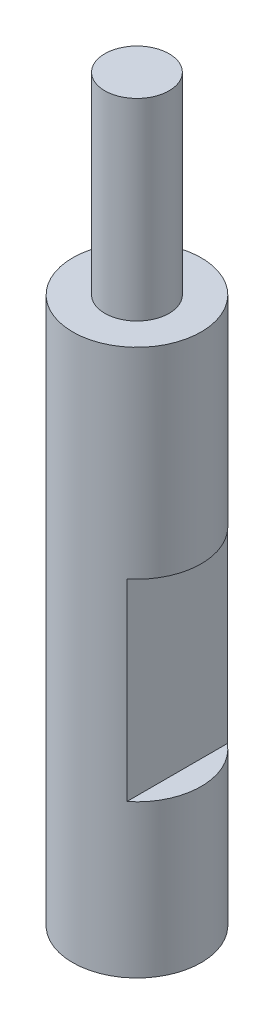
ISO-10303-21;
HEADER;
FILE_DESCRIPTION(('STEP AP214'),'2;1');
FILE_NAME('part.step','',(''),(''),'','','');
FILE_SCHEMA(('AUTOMOTIVE_DESIGN { 1 0 10303 214 1 1 1 1 }'));
ENDSEC;
DATA;
#1=APPLICATION_CONTEXT('core data for automotive mechanical design processes');
#2=APPLICATION_PROTOCOL_DEFINITION('international standard','automotive_design',2000,#1);
#3=PRODUCT_CONTEXT('',#1,'mechanical');
#4=PRODUCT('Part','Part','',(#3));
#5=PRODUCT_RELATED_PRODUCT_CATEGORY('part','',(#4));
#6=PRODUCT_DEFINITION_FORMATION('','',#4);
#7=PRODUCT_DEFINITION_CONTEXT('part definition',#1,'design');
#8=PRODUCT_DEFINITION('design','',#6,#7);
#9=PRODUCT_DEFINITION_SHAPE('','',#8);
#10=(LENGTH_UNIT() NAMED_UNIT(*) SI_UNIT(.MILLI.,.METRE.));
#11=(NAMED_UNIT(*) PLANE_ANGLE_UNIT() SI_UNIT($,.RADIAN.));
#12=(NAMED_UNIT(*) SI_UNIT($,.STERADIAN.) SOLID_ANGLE_UNIT());
#13=UNCERTAINTY_MEASURE_WITH_UNIT(LENGTH_MEASURE(1.E-05),#10,'distance_accuracy_value','');
#14=(GEOMETRIC_REPRESENTATION_CONTEXT(3) GLOBAL_UNCERTAINTY_ASSIGNED_CONTEXT((#13)) GLOBAL_UNIT_ASSIGNED_CONTEXT((#10,
#11,#12)) REPRESENTATION_CONTEXT('',''));
#15=CARTESIAN_POINT('',(0.,0.,0.));
#16=DIRECTION('',(0.,0.,1.));
#17=DIRECTION('',(1.,0.,0.));
#18=AXIS2_PLACEMENT_3D('',#15,#16,#17);
#19=CARTESIAN_POINT('',(0.,34.,0.));
#20=DIRECTION('',(0.,-1.,0.));
#21=DIRECTION('',(0.,0.,-1.));
#22=AXIS2_PLACEMENT_3D('',#19,#20,#21);
#23=CYLINDRICAL_SURFACE('',#22,4.);
#24=CARTESIAN_POINT('',(-3.46410161513775,11.5,-2.));
#25=CARTESIAN_POINT('',(-3.46411185715887,11.6042132054743,-1.99999158748781));
#26=CARTESIAN_POINT('',(-3.46887633544978,11.7085621765338,-1.99179963610437));
#27=CARTESIAN_POINT('',(-3.48724701669072,11.9140551772306,-1.95944672580053));
#28=CARTESIAN_POINT('',(-3.50087179788182,12.0151920032478,-1.93525221095662));
#29=CARTESIAN_POINT('',(-3.53498701490001,12.2109031564469,-1.8721998159803));
#30=CARTESIAN_POINT('',(-3.55544089069169,12.3055092588492,-1.83341988295964));
#31=CARTESIAN_POINT('',(-3.60085327291132,12.4868484504762,-1.74253507245138));
#32=CARTESIAN_POINT('',(-3.62581202301253,12.5735811134368,-1.69042947410139));
#33=CARTESIAN_POINT('',(-3.67993738819289,12.7446114431334,-1.569333074538));
#34=CARTESIAN_POINT('',(-3.70928127465103,12.8281182675918,-1.49930407053533));
#35=CARTESIAN_POINT('',(-3.76743965382121,12.9828167805706,-1.34650761698202));
#36=CARTESIAN_POINT('',(-3.79625387610258,13.054002326204,-1.26373385204841));
#37=CARTESIAN_POINT('',(-3.85242953961661,13.1867343011885,-1.08097912631265));
#38=CARTESIAN_POINT('',(-3.87956212851245,13.2473075354233,-0.980214377887153));
#39=CARTESIAN_POINT('',(-3.92701512184167,13.3502817067871,-0.768314053336918));
#40=CARTESIAN_POINT('',(-3.94733982363631,13.3926941123508,-0.657185076311987));
#41=CARTESIAN_POINT('',(-3.97760922492053,13.4550093225312,-0.436089887818819));
#42=CARTESIAN_POINT('',(-3.98818960442739,13.4762990526921,-0.326603580968787));
#43=CARTESIAN_POINT('',(-4.00015167691179,13.500332237369,-0.105141257404542));
#44=CARTESIAN_POINT('',(-4.00153893568934,13.5030869135963,0.00683321168520598));
#45=CARTESIAN_POINT('',(-3.99525963833124,13.4905066520549,0.219665048849571));
#46=CARTESIAN_POINT('',(-3.98836991784381,13.4767239689564,0.320642398354137));
#47=CARTESIAN_POINT('',(-3.96748490519435,13.4342383121919,0.518627543836087));
#48=CARTESIAN_POINT('',(-3.95348908132771,13.4055342220479,0.6156350421877));
#49=CARTESIAN_POINT('',(-3.91943166575325,13.33383486782,0.804618783139258));
#50=CARTESIAN_POINT('',(-3.89928883058403,13.2906473736558,0.896506847030397));
#51=CARTESIAN_POINT('',(-3.8547529197337,13.1914731675971,1.07195360302662));
#52=CARTESIAN_POINT('',(-3.83035832314967,13.1354818733953,1.15550929767728));
#53=CARTESIAN_POINT('',(-3.7768878879846,13.0062092969339,1.3203473217964));
#54=CARTESIAN_POINT('',(-3.7475875199635,12.931793943348,1.40066815005872));
#55=CARTESIAN_POINT('',(-3.68908681173623,12.7708205501397,1.54820874059556));
#56=CARTESIAN_POINT('',(-3.65988656531257,12.6842532554519,1.61541842314846));
#57=CARTESIAN_POINT('',(-3.60288312184969,12.4947036151518,1.73901066928442));
#58=CARTESIAN_POINT('',(-3.57528639981415,12.3910279538916,1.7944346299561));
#59=CARTESIAN_POINT('',(-3.52750900557152,12.174124657282,1.88663822600246));
#60=CARTESIAN_POINT('',(-3.50732060092135,12.0609071339649,1.92343731642178));
#61=CARTESIAN_POINT('',(-3.47889271634069,11.8375709774344,1.97436042205008));
#62=CARTESIAN_POINT('',(-3.46983311696993,11.7279177619129,1.99005024423995));
#63=CARTESIAN_POINT('',(-3.46235838723219,11.5071973169669,2.00303389322285));
#64=CARTESIAN_POINT('',(-3.46393573778623,11.3961311417604,2.00034071463005));
#65=CARTESIAN_POINT('',(-3.4766867308117,11.1886921628426,1.97807208668793));
#66=CARTESIAN_POINT('',(-3.48679175013308,11.0920410977842,1.96037563342492));
#67=CARTESIAN_POINT('',(-3.51388043102682,10.903264427458,1.91139256926489));
#68=CARTESIAN_POINT('',(-3.53086632010068,10.8111402985065,1.88010155724727));
#69=CARTESIAN_POINT('',(-3.57072444159313,10.6291773381949,1.80329517720973));
#70=CARTESIAN_POINT('',(-3.59383286486125,10.5396419662939,1.7571881273853));
#71=CARTESIAN_POINT('',(-3.643122389945,10.369061456921,1.65257412803176));
#72=CARTESIAN_POINT('',(-3.66930506710298,10.2880207129695,1.59406080866499));
#73=CARTESIAN_POINT('',(-3.72575996912669,10.1260424649573,1.45767433439709));
#74=CARTESIAN_POINT('',(-3.75613166308566,10.0464056985822,1.37829054462748));
#75=CARTESIAN_POINT('',(-3.81468469955797,9.90117552399527,1.20680899079904));
#76=CARTESIAN_POINT('',(-3.84286530015463,9.83558685947316,1.11470694931991));
#77=CARTESIAN_POINT('',(-3.89482723381867,9.71885254816729,0.91707072510806));
#78=CARTESIAN_POINT('',(-3.91847283343884,9.66813376383323,0.811246195112496));
#79=CARTESIAN_POINT('',(-3.95766709918776,9.58572419203039,0.591044729317866));
#80=CARTESIAN_POINT('',(-3.97322287353397,9.5540166963159,0.476675402917653));
#81=CARTESIAN_POINT('',(-3.99335016363174,9.51326287251486,0.253959364539765));
#82=CARTESIAN_POINT('',(-3.9987985581427,9.50240425133572,0.146022887268302));
#83=CARTESIAN_POINT('',(-4.00084260752374,9.49831346600432,-0.0702519714699439));
#84=CARTESIAN_POINT('',(-3.99744136141634,9.50507513147113,-0.178590198981613));
#85=CARTESIAN_POINT('',(-3.98267937668509,9.5348328243164,-0.385075986136858));
#86=CARTESIAN_POINT('',(-3.97185789309443,9.55672973730905,-0.483424641057418));
#87=CARTESIAN_POINT('',(-3.94384187353387,9.61465395980667,-0.674891898931564));
#88=CARTESIAN_POINT('',(-3.92664642364424,9.65068329570691,-0.768009749669771));
#89=CARTESIAN_POINT('',(-3.8865186139318,9.7374542549914,-0.95084683359674));
#90=CARTESIAN_POINT('',(-3.86337234005404,9.78875921975186,-1.0402503657229));
#91=CARTESIAN_POINT('',(-3.81376266676027,9.90391528811809,-1.20954920326828));
#92=CARTESIAN_POINT('',(-3.78729774583427,9.96777215410157,-1.28944011444319));
#93=CARTESIAN_POINT('',(-3.73057218840582,10.1135966355594,-1.44582833859495));
#94=CARTESIAN_POINT('',(-3.70019591726075,10.1967341808003,-1.52119665879199));
#95=CARTESIAN_POINT('',(-3.64126158628571,10.3748922283061,-1.65732528394006));
#96=CARTESIAN_POINT('',(-3.61270515130784,10.4699231313605,-1.71807266521244));
#97=CARTESIAN_POINT('',(-3.55999186256751,10.6733088941302,-1.82486714716811));
#98=CARTESIAN_POINT('',(-3.53600256268535,10.7819899107353,-1.87038902381914));
#99=CARTESIAN_POINT('',(-3.5069621813237,10.9505781196309,-1.92395929504801));
#100=CARTESIAN_POINT('',(-3.49844389329401,11.0076478205907,-1.93935666147967));
#101=CARTESIAN_POINT('',(-3.48406059323535,11.1232325575002,-1.96508069805043));
#102=CARTESIAN_POINT('',(-3.4781937263605,11.1817465527542,-1.97541091343282));
#103=CARTESIAN_POINT('',(-3.47059023668758,11.2836007892473,-1.9887293296122));
#104=CARTESIAN_POINT('',(-3.46816389731815,11.3267330572501,-1.99295091983786));
#105=CARTESIAN_POINT('',(-3.46491740045177,11.4132356930929,-1.99858810035606));
#106=CARTESIAN_POINT('',(-3.46409735040492,11.4566060766667,-2.00000350293331));
#107=CARTESIAN_POINT('',(-3.46410161513775,11.5,-2.));
#108=B_SPLINE_CURVE_WITH_KNOTS('',3,(#24,#25,#26,#27,#28,#29,#30,#31,#32,#33,#34,#35,#36,#37,
#38,#39,#40,#41,#42,#43,#44,#45,#46,#47,#48,#49,#50,#51,#52,#53,#54,#55,#56,#57,#58,#59,#60,#61,
#62,#63,#64,#65,#66,#67,#68,#69,#70,#71,#72,#73,#74,#75,#76,#77,#78,#79,#80,#81,#82,#83,#84,#85,
#86,#87,#88,#89,#90,#91,#92,#93,#94,#95,#96,#97,#98,#99,#100,#101,#102,#103,#104,#105,#106,
#107),.UNSPECIFIED.,.T.,.F.,(4,2,2,2,2,2,2,2,2,2,2,2,2,2,2,2,2,2,2,2,2,2,2,2,2,2,2,2,2,2,2,2,2,
2,2,2,2,2,2,2,2,4),(0.,0.312464245189432,0.62558578564961,0.937057191861534,1.24854545093096,
1.58572462503713,1.92307142172809,2.28315784481594,2.64301653931849,2.97726969939937,
3.31132047376147,3.61632194973143,3.92134625038977,4.2305906946636,4.5399459870461,
4.87854382917848,5.21740096495904,5.57777683462963,5.93777548427476,6.2692458171249,
6.60048186380813,6.89548366852118,7.19058104876193,7.49934592816242,7.80826972444161,
8.15613487165293,8.50411729960471,8.86128362829998,9.2181355962161,9.5422454078304,
9.8662417359201,10.1688884974705,10.4715786702809,10.7872150144301,11.102996602055,
11.450204837042,11.7977188569438,12.1562149808128,12.3351395323571,12.5139387197526,
12.6440387634036,12.7741475095882),.UNSPECIFIED.);
#109=CARTESIAN_POINT('',(-3.46410161513775,11.5,-2.));
#110=VERTEX_POINT('',#109);
#111=EDGE_CURVE('E120',#110,#110,#108,.T.);
#112=ORIENTED_EDGE('',*,*,#111,.T.);
#113=EDGE_LOOP('',(#112));
#114=FACE_BOUND('',#113,.T.);
#115=DIRECTION('',(0.,-1.,0.));
#116=VECTOR('',#115,1.);
#117=CARTESIAN_POINT('',(2.5,34.,3.1224989991992));
#118=LINE('',#117,#116);
#119=CARTESIAN_POINT('',(2.5,9.5,3.1224989991992));
#120=VERTEX_POINT('',#119);
#121=CARTESIAN_POINT('',(2.5,21.5,3.1224989991992));
#122=VERTEX_POINT('',#121);
#123=EDGE_CURVE('E154',#120,#122,#118,.F.);
#124=ORIENTED_EDGE('',*,*,#123,.T.);
#125=CARTESIAN_POINT('',(0.,21.5,0.));
#126=DIRECTION('',(0.,1.,0.));
#127=DIRECTION('',(-1.,0.,0.));
#128=AXIS2_PLACEMENT_3D('',#125,#126,#127);
#129=CIRCLE('',#128,4.);
#130=CARTESIAN_POINT('',(2.5,21.5,-3.1224989991992));
#131=VERTEX_POINT('',#130);
#132=EDGE_CURVE('E60',#122,#131,#129,.T.);
#133=ORIENTED_EDGE('',*,*,#132,.T.);
#134=DIRECTION('',(0.,-1.,0.));
#135=VECTOR('',#134,1.);
#136=CARTESIAN_POINT('',(2.5,34.,-3.1224989991992));
#137=LINE('',#136,#135);
#138=CARTESIAN_POINT('',(2.5,9.5,-3.1224989991992));
#139=VERTEX_POINT('',#138);
#140=EDGE_CURVE('E157',#131,#139,#137,.T.);
#141=ORIENTED_EDGE('',*,*,#140,.T.);
#142=CARTESIAN_POINT('',(0.,9.49999999999999,0.));
#143=DIRECTION('',(0.,-1.,0.));
#144=DIRECTION('',(1.,0.,0.));
#145=AXIS2_PLACEMENT_3D('',#142,#143,#144);
#146=CIRCLE('',#145,4.);
#147=EDGE_CURVE('E147',#139,#120,#146,.T.);
#148=ORIENTED_EDGE('',*,*,#147,.T.);
#149=EDGE_LOOP('',(#124,#133,#141,#148));
#150=FACE_BOUND('',#149,.T.);
#151=CARTESIAN_POINT('',(0.,34.,0.));
#152=DIRECTION('',(0.,1.,0.));
#153=DIRECTION('',(0.,0.,1.));
#154=AXIS2_PLACEMENT_3D('',#151,#152,#153);
#155=CIRCLE('',#154,4.);
#156=CARTESIAN_POINT('',(0.,34.,4.));
#157=VERTEX_POINT('',#156);
#158=EDGE_CURVE('E148',#157,#157,#155,.T.);
#159=ORIENTED_EDGE('',*,*,#158,.F.);
#160=EDGE_LOOP('',(#159));
#161=FACE_BOUND('',#160,.T.);
#162=CARTESIAN_POINT('',(0.,0.,0.));
#163=DIRECTION('',(0.,1.,0.));
#164=DIRECTION('',(0.,0.,1.));
#165=AXIS2_PLACEMENT_3D('',#162,#163,#164);
#166=CIRCLE('',#165,4.);
#167=CARTESIAN_POINT('',(0.,0.,4.));
#168=VERTEX_POINT('',#167);
#169=EDGE_CURVE('E143',#168,#168,#166,.T.);
#170=ORIENTED_EDGE('',*,*,#169,.T.);
#171=EDGE_LOOP('',(#170));
#172=FACE_BOUND('',#171,.T.);
#173=ADVANCED_FACE('F39',(#114,#150,#161,#172),#23,.T.);
#174=CARTESIAN_POINT('',(0.,34.,0.));
#175=DIRECTION('',(0.,1.,0.));
#176=DIRECTION('',(0.,0.,1.));
#177=AXIS2_PLACEMENT_3D('',#174,#175,#176);
#178=PLANE('',#177);
#179=CARTESIAN_POINT('',(0.,34.,0.));
#180=DIRECTION('',(0.,1.,0.));
#181=DIRECTION('',(0.,0.,1.));
#182=AXIS2_PLACEMENT_3D('',#179,#180,#181);
#183=CIRCLE('',#182,2.);
#184=CARTESIAN_POINT('',(0.,34.,2.));
#185=VERTEX_POINT('',#184);
#186=EDGE_CURVE('E144',#185,#185,#183,.T.);
#187=ORIENTED_EDGE('',*,*,#186,.F.);
#188=EDGE_LOOP('',(#187));
#189=FACE_BOUND('',#188,.T.);
#190=ORIENTED_EDGE('',*,*,#158,.T.);
#191=EDGE_LOOP('',(#190));
#192=FACE_BOUND('',#191,.T.);
#193=ADVANCED_FACE('F180',(#189,#192),#178,.T.);
#194=CARTESIAN_POINT('',(0.,0.,0.));
#195=DIRECTION('',(0.,1.,0.));
#196=DIRECTION('',(0.,0.,1.));
#197=AXIS2_PLACEMENT_3D('',#194,#195,#196);
#198=PLANE('',#197);
#199=CARTESIAN_POINT('',(0.,0.,0.));
#200=DIRECTION('',(0.,-1.,0.));
#201=DIRECTION('',(0.,0.,-1.));
#202=AXIS2_PLACEMENT_3D('',#199,#200,#201);
#203=CIRCLE('',#202,1.525);
#204=CARTESIAN_POINT('',(0.,0.,-1.525));
#205=VERTEX_POINT('',#204);
#206=EDGE_CURVE('E126',#205,#205,#203,.T.);
#207=ORIENTED_EDGE('',*,*,#206,.F.);
#208=EDGE_LOOP('',(#207));
#209=FACE_BOUND('',#208,.T.);
#210=ORIENTED_EDGE('',*,*,#169,.F.);
#211=EDGE_LOOP('',(#210));
#212=FACE_BOUND('',#211,.T.);
#213=ADVANCED_FACE('F185',(#209,#212),#198,.F.);
#214=CARTESIAN_POINT('',(0.,46.,0.));
#215=DIRECTION('',(0.,-1.,0.));
#216=DIRECTION('',(0.,0.,-1.));
#217=AXIS2_PLACEMENT_3D('',#214,#215,#216);
#218=CYLINDRICAL_SURFACE('',#217,2.);
#219=CARTESIAN_POINT('',(0.,46.,0.));
#220=DIRECTION('',(0.,1.,0.));
#221=DIRECTION('',(0.,0.,1.));
#222=AXIS2_PLACEMENT_3D('',#219,#220,#221);
#223=CIRCLE('',#222,2.);
#224=CARTESIAN_POINT('',(0.,46.,2.));
#225=VERTEX_POINT('',#224);
#226=EDGE_CURVE('E138',#225,#225,#223,.T.);
#227=ORIENTED_EDGE('',*,*,#226,.F.);
#228=EDGE_LOOP('',(#227));
#229=FACE_BOUND('',#228,.T.);
#230=ORIENTED_EDGE('',*,*,#186,.T.);
#231=EDGE_LOOP('',(#230));
#232=FACE_BOUND('',#231,.T.);
#233=ADVANCED_FACE('F192',(#229,#232),#218,.T.);
#234=CARTESIAN_POINT('',(0.,46.,0.));
#235=DIRECTION('',(0.,1.,0.));
#236=DIRECTION('',(0.,0.,1.));
#237=AXIS2_PLACEMENT_3D('',#234,#235,#236);
#238=PLANE('',#237);
#239=ORIENTED_EDGE('',*,*,#226,.T.);
#240=EDGE_LOOP('',(#239));
#241=FACE_BOUND('',#240,.T.);
#242=ADVANCED_FACE('F199',(#241),#238,.T.);
#243=CARTESIAN_POINT('',(2.5,9.5,-4.));
#244=DIRECTION('',(-1.,0.,0.));
#245=DIRECTION('',(0.,0.,1.));
#246=AXIS2_PLACEMENT_3D('',#243,#244,#245);
#247=PLANE('',#246);
#248=DIRECTION('',(0.,0.,1.));
#249=VECTOR('',#248,1.);
#250=CARTESIAN_POINT('',(2.5,21.5,-4.));
#251=LINE('',#250,#249);
#252=EDGE_CURVE('E136',#131,#122,#251,.T.);
#253=ORIENTED_EDGE('',*,*,#252,.T.);
#254=ORIENTED_EDGE('',*,*,#123,.F.);
#255=DIRECTION('',(0.,0.,1.));
#256=VECTOR('',#255,1.);
#257=CARTESIAN_POINT('',(2.5,9.5,-4.));
#258=LINE('',#257,#256);
#259=EDGE_CURVE('E135',#139,#120,#258,.T.);
#260=ORIENTED_EDGE('',*,*,#259,.F.);
#261=ORIENTED_EDGE('',*,*,#140,.F.);
#262=EDGE_LOOP('',(#253,#254,#260,#261));
#263=FACE_BOUND('',#262,.T.);
#264=ADVANCED_FACE('F165',(#263),#247,.F.);
#265=CARTESIAN_POINT('',(4.,21.5,-4.));
#266=DIRECTION('',(0.,1.,0.));
#267=DIRECTION('',(-1.,0.,0.));
#268=AXIS2_PLACEMENT_3D('',#265,#266,#267);
#269=PLANE('',#268);
#270=ORIENTED_EDGE('',*,*,#252,.F.);
#271=ORIENTED_EDGE('',*,*,#132,.F.);
#272=EDGE_LOOP('',(#270,#271));
#273=FACE_BOUND('',#272,.T.);
#274=ADVANCED_FACE('F170',(#273),#269,.F.);
#275=CARTESIAN_POINT('',(4.,9.5,-4.));
#276=DIRECTION('',(0.,-1.,0.));
#277=DIRECTION('',(1.,0.,0.));
#278=AXIS2_PLACEMENT_3D('',#275,#276,#277);
#279=PLANE('',#278);
#280=ORIENTED_EDGE('',*,*,#147,.F.);
#281=ORIENTED_EDGE('',*,*,#259,.T.);
#282=EDGE_LOOP('',(#280,#281));
#283=FACE_BOUND('',#282,.T.);
#284=ADVANCED_FACE('F167',(#283),#279,.F.);
#285=CARTESIAN_POINT('',(0.,14.,0.));
#286=DIRECTION('',(0.,-1.,0.));
#287=DIRECTION('',(0.,0.,-1.));
#288=AXIS2_PLACEMENT_3D('',#285,#286,#287);
#289=CONICAL_SURFACE('',#288,1.25,1.02974425867665);
#290=CARTESIAN_POINT('',(0.,14.7510757737845,0.));
#291=VERTEX_POINT('',#290);
#292=VERTEX_LOOP('',#291);
#293=FACE_BOUND('',#292,.T.);
#294=CARTESIAN_POINT('',(0.,14.,0.));
#295=DIRECTION('',(0.,-1.,0.));
#296=DIRECTION('',(0.,0.,-1.));
#297=AXIS2_PLACEMENT_3D('',#294,#295,#296);
#298=CIRCLE('',#297,1.25);
#299=CARTESIAN_POINT('',(0.,14.,-1.25));
#300=VERTEX_POINT('',#299);
#301=EDGE_CURVE('E132',#300,#300,#298,.T.);
#302=ORIENTED_EDGE('',*,*,#301,.T.);
#303=EDGE_LOOP('',(#302));
#304=FACE_BOUND('',#303,.T.);
#305=ADVANCED_FACE('F169',(#293,#304),#289,.F.);
#306=CARTESIAN_POINT('',(0.,0.,0.));
#307=DIRECTION('',(0.,-1.,0.));
#308=DIRECTION('',(0.,0.,-1.));
#309=AXIS2_PLACEMENT_3D('',#306,#307,#308);
#310=CYLINDRICAL_SURFACE('',#309,1.25);
#311=CARTESIAN_POINT('',(0.,9.9387505004004,-1.25));
#312=CARTESIAN_POINT('',(-0.0313025675185258,9.93876116994548,-1.25000410674242));
#313=CARTESIAN_POINT('',(-0.0625843427647944,9.93780800218665,-1.24882345645084));
#314=CARTESIAN_POINT('',(-0.124830430382353,9.93407366864904,-1.24414178750192));
#315=CARTESIAN_POINT('',(-0.155795052986643,9.93129450654418,-1.24064331217195));
#316=CARTESIAN_POINT('',(-0.247320508717557,9.92043309735024,-1.22682873094628));
#317=CARTESIAN_POINT('',(-0.307115580539871,9.90982308350953,-1.21319132642574));
#318=CARTESIAN_POINT('',(-0.422726311860138,9.88351676528618,-1.17790272399994));
#319=CARTESIAN_POINT('',(-0.47855677122131,9.86784073813669,-1.15628342609722));
#320=CARTESIAN_POINT('',(-0.585877779825674,9.83321687156945,-1.1057906462993));
#321=CARTESIAN_POINT('',(-0.637357166832952,9.8142609758202,-1.07689922050879));
#322=CARTESIAN_POINT('',(-0.741880080610003,9.77219853905105,-1.00823047604426));
#323=CARTESIAN_POINT('',(-0.79422058707037,9.74887530482688,-0.967516280097075));
#324=CARTESIAN_POINT('',(-0.891904356447491,9.70246053429361,-0.878285084006415));
#325=CARTESIAN_POINT('',(-0.937244949975694,9.67936908949961,-0.829765121497915));
#326=CARTESIAN_POINT('',(-1.02510210688889,9.63270631994537,-0.719188675286586));
#327=CARTESIAN_POINT('',(-1.06661486178481,9.6094143708133,-0.656204879294357));
#328=CARTESIAN_POINT('',(-1.13812312565613,9.5681689074968,-0.522408898098651));
#329=CARTESIAN_POINT('',(-1.16812926148095,9.5502104710622,-0.451604014237744));
#330=CARTESIAN_POINT('',(-1.21248229981598,9.52330159793573,-0.311776937335223));
#331=CARTESIAN_POINT('',(-1.22811138956317,9.51362079351756,-0.243305763008788));
#332=CARTESIAN_POINT('',(-1.24763206005979,9.50149456112136,-0.104105233186103));
#333=CARTESIAN_POINT('',(-1.2515359580861,9.49904154043078,-0.0333783263470934));
#334=CARTESIAN_POINT('',(-1.24764431157521,9.50147090831066,0.0980657990925435));
#335=CARTESIAN_POINT('',(-1.24134862797686,9.50541299807034,0.158852464486462));
#336=CARTESIAN_POINT('',(-1.22013303208335,9.51854726837245,0.278306588004114));
#337=CARTESIAN_POINT('',(-1.20521245955993,9.52773985083521,0.336973883526471));
#338=CARTESIAN_POINT('',(-1.16739571740486,9.55061896662961,0.450890624798711));
#339=CARTESIAN_POINT('',(-1.14447893723166,9.56431710793479,0.506130799401657));
#340=CARTESIAN_POINT('',(-1.09152967925483,9.59514457898753,0.612021904047866));
#341=CARTESIAN_POINT('',(-1.06149595568552,9.6122745093619,0.662672028490287));
#342=CARTESIAN_POINT('',(-0.990978220245425,9.65106417693745,0.764704126165751));
#343=CARTESIAN_POINT('',(-0.949659329905009,9.67302229815595,0.815394723944184));
#344=CARTESIAN_POINT('',(-0.859884939765665,9.71803735069553,0.909583410213123));
#345=CARTESIAN_POINT('',(-0.81141663246509,9.74109620266088,0.953068287164381));
#346=CARTESIAN_POINT('',(-0.701234886840697,9.78931078438612,1.03739874039605));
#347=CARTESIAN_POINT('',(-0.638617836219281,9.81434348499973,1.07714519388513));
#348=CARTESIAN_POINT('',(-0.506222578137451,9.85989955009263,1.14531753420709));
#349=CARTESIAN_POINT('',(-0.43647264563513,9.88043977811737,1.17378609369259));
#350=CARTESIAN_POINT('',(-0.306056186210187,9.91002317954593,1.21345069311339));
#351=CARTESIAN_POINT('',(-0.246460737772083,9.92056035083722,1.22699176340493));
#352=CARTESIAN_POINT('',(-0.155247500762039,9.93134649246867,1.2407088539905));
#353=CARTESIAN_POINT('',(-0.124392658679601,9.93410620688315,1.24418265956685));
#354=CARTESIAN_POINT('',(-0.0623650711400601,9.93781476106318,1.24883189250733));
#355=CARTESIAN_POINT('',(-0.031191981072018,9.93876136724887,1.25000448503577));
#356=CARTESIAN_POINT('',(0.,9.9387505004004,1.25));
#357=B_SPLINE_CURVE_WITH_KNOTS('',3,(#311,#312,#313,#314,#315,#316,#317,#318,#319,#320,#321,
#322,#323,#324,#325,#326,#327,#328,#329,#330,#331,#332,#333,#334,#335,#336,#337,#338,#339,#340,
#341,#342,#343,#344,#345,#346,#347,#348,#349,#350,#351,#352,#353,#354,#355,#356),.UNSPECIFIED.,
.F.,.F.,(4,2,2,2,2,2,2,2,2,2,2,2,2,2,2,2,2,2,2,2,2,2,4),(0.,0.0938325753541517,0.1875623592661,
0.373242561301322,0.558188577994115,0.743595498949715,0.953668143170618,1.16382070091259,
1.39937534327446,1.63471191400854,1.84611491875106,2.05729576749376,2.24013409343254,
2.42298641735085,2.60631357509932,2.78967284657848,2.99582019686382,3.20234142927744,
3.43602172065746,3.66880918185035,3.85385213012409,3.9472421058468,4.0407470554802),.UNSPECIFIED.);
#358=CARTESIAN_POINT('',(0.,9.9387505004004,-1.25));
#359=VERTEX_POINT('',#358);
#360=CARTESIAN_POINT('',(0.,9.9387505004004,1.25));
#361=VERTEX_POINT('',#360);
#362=EDGE_CURVE('E87',#359,#361,#357,.T.);
#363=ORIENTED_EDGE('',*,*,#362,.T.);
#364=DIRECTION('',(0.,-1.,0.));
#365=VECTOR('',#364,1.);
#366=CARTESIAN_POINT('',(0.,0.,1.25));
#367=LINE('',#366,#365);
#368=CARTESIAN_POINT('',(0.,13.0612494995996,1.25));
#369=VERTEX_POINT('',#368);
#370=EDGE_CURVE('E11',#361,#369,#367,.F.);
#371=ORIENTED_EDGE('',*,*,#370,.T.);
#372=CARTESIAN_POINT('',(0.,13.0612494995996,1.25));
#373=CARTESIAN_POINT('',(-0.0313025675185258,13.0612388300545,1.25000410674242));
#374=CARTESIAN_POINT('',(-0.0625843427647944,13.0621919978133,1.24882345645084));
#375=CARTESIAN_POINT('',(-0.124830430382353,13.065926331351,1.24414178750192));
#376=CARTESIAN_POINT('',(-0.155795052986643,13.0687054934558,1.24064331217195));
#377=CARTESIAN_POINT('',(-0.247320508717557,13.0795669026498,1.22682873094628));
#378=CARTESIAN_POINT('',(-0.307115580539871,13.0901769164905,1.21319132642574));
#379=CARTESIAN_POINT('',(-0.422726311860138,13.1164832347138,1.17790272399994));
#380=CARTESIAN_POINT('',(-0.47855677122131,13.1321592618633,1.15628342609722));
#381=CARTESIAN_POINT('',(-0.585877779825673,13.1667831284306,1.1057906462993));
#382=CARTESIAN_POINT('',(-0.637357166832952,13.1857390241798,1.07689922050879));
#383=CARTESIAN_POINT('',(-0.741880080610003,13.227801460949,1.00823047604426));
#384=CARTESIAN_POINT('',(-0.79422058707037,13.2511246951731,0.967516280097075));
#385=CARTESIAN_POINT('',(-0.891904356447491,13.2975394657064,0.878285084006415));
#386=CARTESIAN_POINT('',(-0.937244949975694,13.3206309105004,0.829765121497915));
#387=CARTESIAN_POINT('',(-1.02510210688889,13.3672936800546,0.719188675286586));
#388=CARTESIAN_POINT('',(-1.06661486178481,13.3905856291867,0.656204879294357));
#389=CARTESIAN_POINT('',(-1.13812312565613,13.4318310925032,0.522408898098651));
#390=CARTESIAN_POINT('',(-1.16812926148095,13.4497895289378,0.451604014237744));
#391=CARTESIAN_POINT('',(-1.21248229981598,13.4766984020643,0.311776937335223));
#392=CARTESIAN_POINT('',(-1.22811138956317,13.4863792064824,0.243305763008789));
#393=CARTESIAN_POINT('',(-1.24763206005979,13.4985054388786,0.104105233186103));
#394=CARTESIAN_POINT('',(-1.2515359580861,13.5009584595692,0.0333783263470935));
#395=CARTESIAN_POINT('',(-1.24764431157521,13.4985290916893,-0.0980657990925435));
#396=CARTESIAN_POINT('',(-1.24134862797686,13.4945870019297,-0.158852464486461));
#397=CARTESIAN_POINT('',(-1.22013303208335,13.4814527316275,-0.278306588004114));
#398=CARTESIAN_POINT('',(-1.20521245955993,13.4722601491648,-0.336973883526471));
#399=CARTESIAN_POINT('',(-1.16739571740486,13.4493810333704,-0.450890624798711));
#400=CARTESIAN_POINT('',(-1.14447893723166,13.4356828920652,-0.506130799401656));
#401=CARTESIAN_POINT('',(-1.09152967925483,13.4048554210125,-0.612021904047866));
#402=CARTESIAN_POINT('',(-1.06149595568552,13.3877254906381,-0.662672028490287));
#403=CARTESIAN_POINT('',(-0.990978220245425,13.3489358230625,-0.764704126165751));
#404=CARTESIAN_POINT('',(-0.949659329905009,13.326977701844,-0.815394723944184));
#405=CARTESIAN_POINT('',(-0.859884939765665,13.2819626493045,-0.909583410213123));
#406=CARTESIAN_POINT('',(-0.81141663246509,13.2589037973391,-0.953068287164381));
#407=CARTESIAN_POINT('',(-0.701234886840697,13.2106892156139,-1.03739874039605));
#408=CARTESIAN_POINT('',(-0.638617836219281,13.1856565150003,-1.07714519388513));
#409=CARTESIAN_POINT('',(-0.506222578137451,13.1401004499074,-1.14531753420709));
#410=CARTESIAN_POINT('',(-0.43647264563513,13.1195602218826,-1.17378609369259));
#411=CARTESIAN_POINT('',(-0.306056186210187,13.0899768204541,-1.21345069311339));
#412=CARTESIAN_POINT('',(-0.246460737772083,13.0794396491628,-1.22699176340493));
#413=CARTESIAN_POINT('',(-0.155247500762039,13.0686535075313,-1.2407088539905));
#414=CARTESIAN_POINT('',(-0.124392658679601,13.0658937931168,-1.24418265956685));
#415=CARTESIAN_POINT('',(-0.0623650711400601,13.0621852389368,-1.24883189250733));
#416=CARTESIAN_POINT('',(-0.031191981072018,13.0612386327511,-1.25000448503577));
#417=CARTESIAN_POINT('',(0.,13.0612494995996,-1.25));
#418=B_SPLINE_CURVE_WITH_KNOTS('',3,(#372,#373,#374,#375,#376,#377,#378,#379,#380,#381,#382,
#383,#384,#385,#386,#387,#388,#389,#390,#391,#392,#393,#394,#395,#396,#397,#398,#399,#400,#401,
#402,#403,#404,#405,#406,#407,#408,#409,#410,#411,#412,#413,#414,#415,#416,#417),.UNSPECIFIED.,
.F.,.F.,(4,2,2,2,2,2,2,2,2,2,2,2,2,2,2,2,2,2,2,2,2,2,4),(0.,0.0938325753541517,0.1875623592661,
0.373242561301322,0.558188577994113,0.743595498949715,0.953668143170618,1.16382070091259,
1.39937534327446,1.63471191400854,1.84611491875106,2.05729576749376,2.24013409343254,
2.42298641735085,2.60631357509932,2.78967284657848,2.99582019686382,3.20234142927744,
3.43602172065746,3.66880918185035,3.85385213012409,3.9472421058468,4.0407470554802),.UNSPECIFIED.);
#419=CARTESIAN_POINT('',(0.,13.0612494995996,-1.25));
#420=VERTEX_POINT('',#419);
#421=EDGE_CURVE('E47',#369,#420,#418,.T.);
#422=ORIENTED_EDGE('',*,*,#421,.T.);
#423=DIRECTION('',(0.,-1.,0.));
#424=VECTOR('',#423,1.);
#425=CARTESIAN_POINT('',(0.,0.,-1.25));
#426=LINE('',#425,#424);
#427=EDGE_CURVE('E82',#420,#359,#426,.T.);
#428=ORIENTED_EDGE('',*,*,#427,.T.);
#429=EDGE_LOOP('',(#363,#371,#422,#428));
#430=FACE_BOUND('',#429,.T.);
#431=ORIENTED_EDGE('',*,*,#301,.F.);
#432=EDGE_LOOP('',(#431));
#433=FACE_BOUND('',#432,.T.);
#434=CARTESIAN_POINT('',(0.,0.275000000000001,0.));
#435=DIRECTION('',(0.,-1.,0.));
#436=DIRECTION('',(0.,0.,-1.));
#437=AXIS2_PLACEMENT_3D('',#434,#435,#436);
#438=CIRCLE('',#437,1.25);
#439=CARTESIAN_POINT('',(0.,0.275000000000001,-1.25));
#440=VERTEX_POINT('',#439);
#441=EDGE_CURVE('E129',#440,#440,#438,.T.);
#442=ORIENTED_EDGE('',*,*,#441,.T.);
#443=EDGE_LOOP('',(#442));
#444=FACE_BOUND('',#443,.T.);
#445=ADVANCED_FACE('F96',(#430,#433,#444),#310,.F.);
#446=CARTESIAN_POINT('',(0.,0.,0.));
#447=DIRECTION('',(0.,-1.,0.));
#448=DIRECTION('',(0.,0.,-1.));
#449=AXIS2_PLACEMENT_3D('',#446,#447,#448);
#450=CONICAL_SURFACE('',#449,1.525,0.78539816339745);
#451=ORIENTED_EDGE('',*,*,#441,.F.);
#452=EDGE_LOOP('',(#451));
#453=FACE_BOUND('',#452,.T.);
#454=ORIENTED_EDGE('',*,*,#206,.T.);
#455=EDGE_LOOP('',(#454));
#456=FACE_BOUND('',#455,.T.);
#457=ADVANCED_FACE('F116',(#453,#456),#450,.F.);
#458=CARTESIAN_POINT('',(-12.,11.5,0.));
#459=DIRECTION('',(1.,0.,0.));
#460=DIRECTION('',(0.,0.,-1.));
#461=AXIS2_PLACEMENT_3D('',#458,#459,#460);
#462=CYLINDRICAL_SURFACE('',#461,2.);
#463=CARTESIAN_POINT('',(0.,11.5,0.));
#464=DIRECTION('',(1.,0.,0.));
#465=DIRECTION('',(0.,0.,-1.));
#466=AXIS2_PLACEMENT_3D('',#463,#464,#465);
#467=CIRCLE('',#466,2.);
#468=EDGE_CURVE('E94',#369,#361,#467,.T.);
#469=ORIENTED_EDGE('',*,*,#468,.T.);
#470=ORIENTED_EDGE('',*,*,#362,.F.);
#471=EDGE_CURVE('E53',#359,#420,#467,.T.);
#472=ORIENTED_EDGE('',*,*,#471,.T.);
#473=ORIENTED_EDGE('',*,*,#421,.F.);
#474=EDGE_LOOP('',(#469,#470,#472,#473));
#475=FACE_BOUND('',#474,.T.);
#476=ORIENTED_EDGE('',*,*,#111,.F.);
#477=EDGE_LOOP('',(#476));
#478=FACE_BOUND('',#477,.T.);
#479=ADVANCED_FACE('F91',(#475,#478),#462,.F.);
#480=CARTESIAN_POINT('',(0.,11.5,0.));
#481=DIRECTION('',(1.,0.,0.));
#482=DIRECTION('',(0.,0.,-1.));
#483=AXIS2_PLACEMENT_3D('',#480,#481,#482);
#484=PLANE('',#483);
#485=ORIENTED_EDGE('',*,*,#468,.F.);
#486=ORIENTED_EDGE('',*,*,#370,.F.);
#487=EDGE_LOOP('',(#485,#486));
#488=FACE_BOUND('',#487,.T.);
#489=ADVANCED_FACE('F115',(#488),#484,.F.);
#490=ORIENTED_EDGE('',*,*,#471,.F.);
#491=ORIENTED_EDGE('',*,*,#427,.F.);
#492=EDGE_LOOP('',(#490,#491));
#493=FACE_BOUND('',#492,.T.);
#494=ADVANCED_FACE('F83',(#493),#484,.F.);
#495=CLOSED_SHELL('',(#173,#193,#213,#233,#242,#264,#274,#284,#305,#445,#457,#479,#489,#494));
#496=MANIFOLD_SOLID_BREP('B2',#495);
#497=ADVANCED_BREP_SHAPE_REPRESENTATION('',(#18,#496),#14);
#498=SHAPE_DEFINITION_REPRESENTATION(#9,#497);
ENDSEC;
END-ISO-10303-21;
